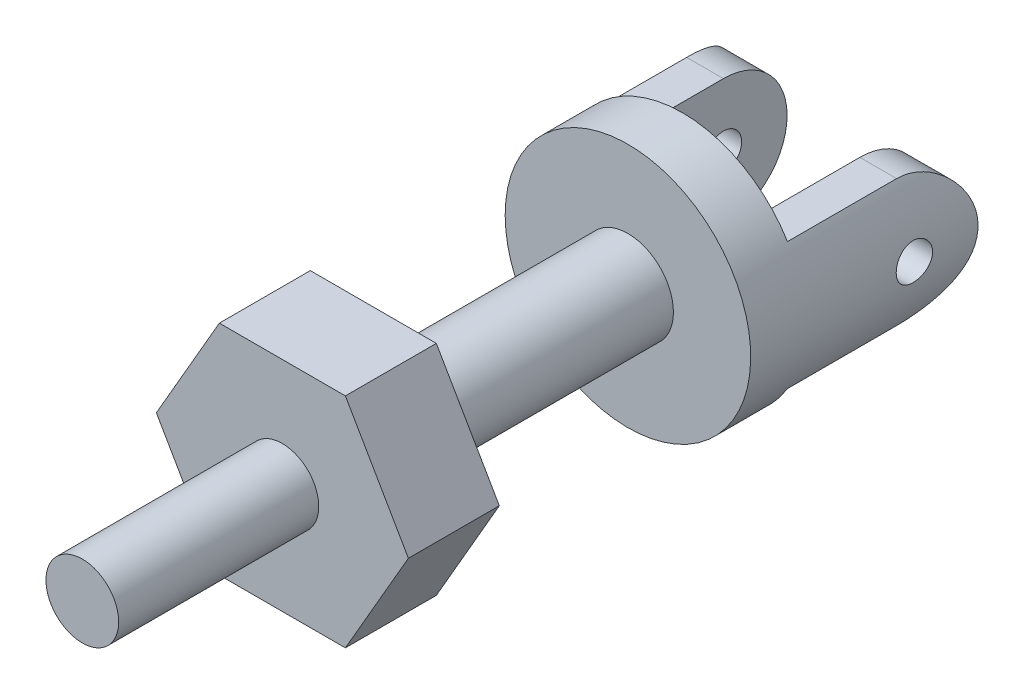
ISO-10303-21;
HEADER;
FILE_DESCRIPTION(('STEP AP214'),'2;1');
FILE_NAME('part.step','',(''),(''),'','','');
FILE_SCHEMA(('AUTOMOTIVE_DESIGN { 1 0 10303 214 1 1 1 1 }'));
ENDSEC;
DATA;
#1=APPLICATION_CONTEXT('core data for automotive mechanical design processes');
#2=APPLICATION_PROTOCOL_DEFINITION('international standard','automotive_design',2000,#1);
#3=PRODUCT_CONTEXT('',#1,'mechanical');
#4=PRODUCT('Part','Part','',(#3));
#5=PRODUCT_RELATED_PRODUCT_CATEGORY('part','',(#4));
#6=PRODUCT_DEFINITION_FORMATION('','',#4);
#7=PRODUCT_DEFINITION_CONTEXT('part definition',#1,'design');
#8=PRODUCT_DEFINITION('design','',#6,#7);
#9=PRODUCT_DEFINITION_SHAPE('','',#8);
#10=(LENGTH_UNIT() NAMED_UNIT(*) SI_UNIT(.MILLI.,.METRE.));
#11=(NAMED_UNIT(*) PLANE_ANGLE_UNIT() SI_UNIT($,.RADIAN.));
#12=(NAMED_UNIT(*) SI_UNIT($,.STERADIAN.) SOLID_ANGLE_UNIT());
#13=UNCERTAINTY_MEASURE_WITH_UNIT(LENGTH_MEASURE(1.E-05),#10,'distance_accuracy_value','');
#14=(GEOMETRIC_REPRESENTATION_CONTEXT(3) GLOBAL_UNCERTAINTY_ASSIGNED_CONTEXT((#13)) GLOBAL_UNIT_ASSIGNED_CONTEXT((#10,
#11,#12)) REPRESENTATION_CONTEXT('',''));
#15=CARTESIAN_POINT('',(0.,0.,0.));
#16=DIRECTION('',(0.,0.,1.));
#17=DIRECTION('',(1.,0.,0.));
#18=AXIS2_PLACEMENT_3D('',#15,#16,#17);
#19=CARTESIAN_POINT('',(0.,0.,-17.));
#20=DIRECTION('',(0.,0.,1.));
#21=DIRECTION('',(1.,0.,0.));
#22=AXIS2_PLACEMENT_3D('',#19,#20,#21);
#23=CYLINDRICAL_SURFACE('',#22,6.75);
#24=CARTESIAN_POINT('',(6.75,0.,-24.));
#25=CARTESIAN_POINT('',(6.74999911272059,-0.055842540910166,-23.9999976909739));
#26=CARTESIAN_POINT('',(6.74929975767196,-0.111717684844449,-23.9953066262002));
#27=CARTESIAN_POINT('',(6.74657719642042,-0.221906738606192,-23.9766707451346));
#28=CARTESIAN_POINT('',(6.74455269374564,-0.276219065053058,-23.9627168662834));
#29=CARTESIAN_POINT('',(6.73940739080019,-0.381671836837065,-23.9259809826003));
#30=CARTESIAN_POINT('',(6.73628741208205,-0.43281462544751,-23.9032055921468));
#31=CARTESIAN_POINT('',(6.72929609307386,-0.530544531243024,-23.8494892287142));
#32=CARTESIAN_POINT('',(6.72542485910577,-0.577132291680522,-23.8185494109893));
#33=CARTESIAN_POINT('',(6.71732864075089,-0.664793017751611,-23.7491309350935));
#34=CARTESIAN_POINT('',(6.71310142384377,-0.705826205517572,-23.7106023010483));
#35=CARTESIAN_POINT('',(6.70478718892022,-0.780869855713781,-23.6272074094649));
#36=CARTESIAN_POINT('',(6.70070017890102,-0.81487991810721,-23.5823407911604));
#37=CARTESIAN_POINT('',(6.69310742202681,-0.875066235908765,-23.4872769283577));
#38=CARTESIAN_POINT('',(6.6896045599627,-0.901204098047282,-23.4370551261348));
#39=CARTESIAN_POINT('',(6.68360711396162,-0.944658716040232,-23.3328737482525));
#40=CARTESIAN_POINT('',(6.68111247643255,-0.961975940767681,-23.2789143714423));
#41=CARTESIAN_POINT('',(6.67743583632494,-0.987174376659307,-23.1692074990302));
#42=CARTESIAN_POINT('',(6.67624437438597,-0.995123620308465,-23.1134759525087));
#43=CARTESIAN_POINT('',(6.67528025275461,-1.0015711832689,-23.0014582086667));
#44=CARTESIAN_POINT('',(6.67550751356993,-1.00007003209414,-22.9451720425985));
#45=CARTESIAN_POINT('',(6.67734650914669,-0.98771503469444,-22.834122886774));
#46=CARTESIAN_POINT('',(6.67894703709383,-0.976936892914969,-22.7793512620758));
#47=CARTESIAN_POINT('',(6.68333472365175,-0.946452342629807,-22.6724025809788));
#48=CARTESIAN_POINT('',(6.68612191507621,-0.926745687231395,-22.6202255963716));
#49=CARTESIAN_POINT('',(6.69258128775432,-0.878884561850783,-22.5197165856181));
#50=CARTESIAN_POINT('',(6.69625682457254,-0.850697959155642,-22.4714000851476));
#51=CARTESIAN_POINT('',(6.70407630948204,-0.786699945498342,-22.3801539640613));
#52=CARTESIAN_POINT('',(6.70822028756469,-0.75088804620629,-22.3372246887274));
#53=CARTESIAN_POINT('',(6.71655927335414,-0.67224013372588,-22.2575328147743));
#54=CARTESIAN_POINT('',(6.7207543845646,-0.629339018930791,-22.2208344453194));
#55=CARTESIAN_POINT('',(6.72868539581363,-0.537952544972292,-22.155148804508));
#56=CARTESIAN_POINT('',(6.73242129392949,-0.48946716242943,-22.126161565437));
#57=CARTESIAN_POINT('',(6.73901671048289,-0.388233293631783,-22.0767179850269));
#58=CARTESIAN_POINT('',(6.74187572726903,-0.335482388854874,-22.0562665244811));
#59=CARTESIAN_POINT('',(6.74639102909035,-0.227243041616983,-22.0245304925167));
#60=CARTESIAN_POINT('',(6.74804739342113,-0.171754779898364,-22.0132453167232));
#61=CARTESIAN_POINT('',(6.74996027662796,-0.0601702510974144,-22.000247433234));
#62=CARTESIAN_POINT('',(6.75022971002842,-0.00408448467763438,-21.9984464094182));
#63=CARTESIAN_POINT('',(6.74937350522533,0.107588256207566,-22.0042336439311));
#64=CARTESIAN_POINT('',(6.74824790911938,0.163175245673515,-22.0118216189294));
#65=CARTESIAN_POINT('',(6.74473610882736,0.272005564748214,-22.0360980220436));
#66=CARTESIAN_POINT('',(6.74235585630278,0.325258684419559,-22.0527434964207));
#67=CARTESIAN_POINT('',(6.736600801366,0.428218204093145,-22.0946171488986));
#68=CARTESIAN_POINT('',(6.73322595324427,0.477924440957679,-22.1198457214687));
#69=CARTESIAN_POINT('',(6.72582473545489,0.572768052310922,-22.1783771366065));
#70=CARTESIAN_POINT('',(6.72179390576589,0.617870444216264,-22.2117360902563));
#71=CARTESIAN_POINT('',(6.71354345616816,0.701868155947209,-22.2855031079937));
#72=CARTESIAN_POINT('',(6.70932382558081,0.740763124109861,-22.3259115711788));
#73=CARTESIAN_POINT('',(6.70113048938946,0.811562616638169,-22.4130234049341));
#74=CARTESIAN_POINT('',(6.69715905164284,0.843407990393645,-22.4597750953769));
#75=CARTESIAN_POINT('',(6.68995170503097,0.898793373321402,-22.5580159613304));
#76=CARTESIAN_POINT('',(6.68671577667948,0.922333602535498,-22.6095050112808));
#77=CARTESIAN_POINT('',(6.68136217784517,0.960348470530135,-22.7155814744695));
#78=CARTESIAN_POINT('',(6.67924064990097,0.974854414016818,-22.7701574657212));
#79=CARTESIAN_POINT('',(6.67634573947977,0.994488675177337,-22.8810047537763));
#80=CARTESIAN_POINT('',(6.67557226638415,0.999617623190394,-22.9372759363674));
#81=CARTESIAN_POINT('',(6.67546436730878,1.00033757943703,-23.0493267995347));
#82=CARTESIAN_POINT('',(6.67611591022978,0.996021584936614,-23.1051058913773));
#83=CARTESIAN_POINT('',(6.67875416313144,0.978173271070795,-23.2151356901121));
#84=CARTESIAN_POINT('',(6.68074087117957,0.964640965045214,-23.2693863992164));
#85=CARTESIAN_POINT('',(6.6858207421393,0.928776749344403,-23.3747947554377));
#86=CARTESIAN_POINT('',(6.68891310765919,0.906451180127707,-23.4259546006592));
#87=CARTESIAN_POINT('',(6.69585685750153,0.853643415012498,-23.5238174857813));
#88=CARTESIAN_POINT('',(6.69970826624953,0.823160956618996,-23.5705203821881));
#89=CARTESIAN_POINT('',(6.70778131838235,0.75456623134579,-23.658616385123));
#90=CARTESIAN_POINT('',(6.7120060970762,0.716385046344522,-23.6999555482106));
#91=CARTESIAN_POINT('',(6.72032356595988,0.633622295064077,-23.7756731917375));
#92=CARTESIAN_POINT('',(6.72441622518943,0.589039241744767,-23.810050050473));
#93=CARTESIAN_POINT('',(6.73203333976492,0.494457481821442,-23.8710314318147));
#94=CARTESIAN_POINT('',(6.73555463068598,0.444431017911157,-23.897593290153));
#95=CARTESIAN_POINT('',(6.74160116950649,0.340598638239511,-23.9418980659904));
#96=CARTESIAN_POINT('',(6.74412745252672,0.28679671917619,-23.9596501534456));
#97=CARTESIAN_POINT('',(6.7473200627825,0.193958660761501,-23.9817862974269));
#98=CARTESIAN_POINT('',(6.74831989929762,0.155496645397279,-23.9886060480909));
#99=CARTESIAN_POINT('',(6.74966017396957,0.0780283890929518,-23.9977136790094));
#100=CARTESIAN_POINT('',(6.75000062002111,0.03902215467426,-24.0000016135221));
#101=CARTESIAN_POINT('',(6.75,0.,-24.));
#102=B_SPLINE_CURVE_WITH_KNOTS('',3,(#24,#25,#26,#27,#28,#29,#30,#31,#32,#33,#34,#35,#36,#37,
#38,#39,#40,#41,#42,#43,#44,#45,#46,#47,#48,#49,#50,#51,#52,#53,#54,#55,#56,#57,#58,#59,#60,#61,
#62,#63,#64,#65,#66,#67,#68,#69,#70,#71,#72,#73,#74,#75,#76,#77,#78,#79,#80,#81,#82,#83,#84,#85,
#86,#87,#88,#89,#90,#91,#92,#93,#94,#95,#96,#97,#98,#99,#100,#101),.UNSPECIFIED.,.T.,.F.,(4,2,2,
2,2,2,2,2,2,2,2,2,2,2,2,2,2,2,2,2,2,2,2,2,2,2,2,2,2,2,2,2,2,2,2,2,2,2,4),(0.,0.167385036095001,
0.334934080339171,0.502357738579202,0.669757719315227,0.838299369512643,1.00685061718639,
1.17621106378315,1.34556250685453,1.51367634882374,1.68178077130974,1.84852625275946,
2.01527634536397,2.18266643054019,2.35006723873285,2.51910075696945,2.68813498291829,
2.85726573135218,3.02638532731912,3.19392726588316,3.36146414868354,3.52821335257178,
3.69497022109769,3.86291226368386,4.03086381714738,4.20017525181088,4.36948220029192,
4.53819917064465,4.70690479910917,4.87395678992066,5.04100853893916,5.20794005372038,
5.37487694113277,5.54338046523498,5.71192319321397,5.88136966036332,6.05063938138702,
6.16760760787006,6.28457443391695),.UNSPECIFIED.);
#103=CARTESIAN_POINT('',(6.75,0.,-24.));
#104=VERTEX_POINT('',#103);
#105=EDGE_CURVE('E367',#104,#104,#102,.T.);
#106=ORIENTED_EDGE('',*,*,#105,.T.);
#107=EDGE_LOOP('',(#106));
#108=FACE_BOUND('',#107,.T.);
#109=CARTESIAN_POINT('',(-6.75,0.,-24.));
#110=CARTESIAN_POINT('',(-6.74999911272059,0.0558425409101661,-23.9999976909739));
#111=CARTESIAN_POINT('',(-6.74929975767196,0.111717684844449,-23.9953066262002));
#112=CARTESIAN_POINT('',(-6.74657719642042,0.221906738606192,-23.9766707451346));
#113=CARTESIAN_POINT('',(-6.74455269374564,0.276219065053058,-23.9627168662834));
#114=CARTESIAN_POINT('',(-6.73940739080019,0.381671836837065,-23.9259809826003));
#115=CARTESIAN_POINT('',(-6.73628741208205,0.43281462544751,-23.9032055921468));
#116=CARTESIAN_POINT('',(-6.72929609307386,0.530544531243024,-23.8494892287142));
#117=CARTESIAN_POINT('',(-6.72542485910577,0.577132291680522,-23.8185494109893));
#118=CARTESIAN_POINT('',(-6.71732864075089,0.664793017751611,-23.7491309350935));
#119=CARTESIAN_POINT('',(-6.71310142384377,0.705826205517572,-23.7106023010483));
#120=CARTESIAN_POINT('',(-6.70478718892022,0.780869855713782,-23.6272074094649));
#121=CARTESIAN_POINT('',(-6.70070017890102,0.81487991810721,-23.5823407911604));
#122=CARTESIAN_POINT('',(-6.69310742202681,0.875066235908764,-23.4872769283577));
#123=CARTESIAN_POINT('',(-6.6896045599627,0.901204098047281,-23.4370551261348));
#124=CARTESIAN_POINT('',(-6.68360711396161,0.944658716040232,-23.3328737482525));
#125=CARTESIAN_POINT('',(-6.68111247643255,0.961975940767681,-23.2789143714423));
#126=CARTESIAN_POINT('',(-6.67743583632494,0.987174376659307,-23.1692074990302));
#127=CARTESIAN_POINT('',(-6.67624437438597,0.995123620308465,-23.1134759525087));
#128=CARTESIAN_POINT('',(-6.67528025275461,1.0015711832689,-23.0014582086667));
#129=CARTESIAN_POINT('',(-6.67550751356993,1.00007003209414,-22.9451720425985));
#130=CARTESIAN_POINT('',(-6.67734650914669,0.98771503469444,-22.834122886774));
#131=CARTESIAN_POINT('',(-6.67894703709383,0.976936892914968,-22.7793512620758));
#132=CARTESIAN_POINT('',(-6.68333472365175,0.946452342629807,-22.6724025809788));
#133=CARTESIAN_POINT('',(-6.68612191507621,0.926745687231396,-22.6202255963716));
#134=CARTESIAN_POINT('',(-6.69258128775432,0.878884561850783,-22.5197165856181));
#135=CARTESIAN_POINT('',(-6.69625682457254,0.850697959155642,-22.4714000851476));
#136=CARTESIAN_POINT('',(-6.70407630948204,0.786699945498342,-22.3801539640613));
#137=CARTESIAN_POINT('',(-6.70822028756469,0.750888046206289,-22.3372246887274));
#138=CARTESIAN_POINT('',(-6.71655927335414,0.672240133725879,-22.2575328147743));
#139=CARTESIAN_POINT('',(-6.7207543845646,0.629339018930791,-22.2208344453194));
#140=CARTESIAN_POINT('',(-6.72868539581363,0.537952544972292,-22.155148804508));
#141=CARTESIAN_POINT('',(-6.73242129392949,0.489467162429429,-22.126161565437));
#142=CARTESIAN_POINT('',(-6.73901671048289,0.388233293631783,-22.0767179850269));
#143=CARTESIAN_POINT('',(-6.74187572726903,0.335482388854874,-22.0562665244811));
#144=CARTESIAN_POINT('',(-6.74639102909035,0.227243041616983,-22.0245304925167));
#145=CARTESIAN_POINT('',(-6.74804739342113,0.171754779898364,-22.0132453167232));
#146=CARTESIAN_POINT('',(-6.74996027662796,0.060170251097414,-22.000247433234));
#147=CARTESIAN_POINT('',(-6.75022971002842,0.00408448467763391,-21.9984464094182));
#148=CARTESIAN_POINT('',(-6.74937350522533,-0.107588256207567,-22.0042336439311));
#149=CARTESIAN_POINT('',(-6.74824790911938,-0.163175245673516,-22.0118216189294));
#150=CARTESIAN_POINT('',(-6.74473610882736,-0.272005564748214,-22.0360980220436));
#151=CARTESIAN_POINT('',(-6.74235585630278,-0.325258684419559,-22.0527434964207));
#152=CARTESIAN_POINT('',(-6.736600801366,-0.428218204093145,-22.0946171488986));
#153=CARTESIAN_POINT('',(-6.73322595324427,-0.47792444095768,-22.1198457214687));
#154=CARTESIAN_POINT('',(-6.72582473545489,-0.572768052310923,-22.1783771366065));
#155=CARTESIAN_POINT('',(-6.72179390576589,-0.617870444216265,-22.2117360902563));
#156=CARTESIAN_POINT('',(-6.71354345616816,-0.70186815594721,-22.2855031079937));
#157=CARTESIAN_POINT('',(-6.70932382558081,-0.740763124109862,-22.3259115711788));
#158=CARTESIAN_POINT('',(-6.70113048938946,-0.81156261663817,-22.4130234049341));
#159=CARTESIAN_POINT('',(-6.69715905164284,-0.843407990393645,-22.4597750953769));
#160=CARTESIAN_POINT('',(-6.68995170503097,-0.898793373321402,-22.5580159613304));
#161=CARTESIAN_POINT('',(-6.68671577667948,-0.922333602535497,-22.6095050112808));
#162=CARTESIAN_POINT('',(-6.68136217784517,-0.960348470530135,-22.7155814744695));
#163=CARTESIAN_POINT('',(-6.67924064990097,-0.974854414016818,-22.7701574657212));
#164=CARTESIAN_POINT('',(-6.67634573947977,-0.994488675177337,-22.8810047537763));
#165=CARTESIAN_POINT('',(-6.67557226638415,-0.999617623190394,-22.9372759363674));
#166=CARTESIAN_POINT('',(-6.67546436730878,-1.00033757943703,-23.0493267995347));
#167=CARTESIAN_POINT('',(-6.67611591022978,-0.996021584936614,-23.1051058913773));
#168=CARTESIAN_POINT('',(-6.67875416313144,-0.978173271070795,-23.2151356901121));
#169=CARTESIAN_POINT('',(-6.68074087117957,-0.964640965045214,-23.2693863992164));
#170=CARTESIAN_POINT('',(-6.6858207421393,-0.928776749344403,-23.3747947554377));
#171=CARTESIAN_POINT('',(-6.68891310765919,-0.906451180127707,-23.4259546006592));
#172=CARTESIAN_POINT('',(-6.69585685750153,-0.853643415012498,-23.5238174857813));
#173=CARTESIAN_POINT('',(-6.69970826624953,-0.823160956618996,-23.5705203821881));
#174=CARTESIAN_POINT('',(-6.70778131838235,-0.75456623134579,-23.658616385123));
#175=CARTESIAN_POINT('',(-6.7120060970762,-0.716385046344522,-23.6999555482106));
#176=CARTESIAN_POINT('',(-6.72032356595988,-0.633622295064077,-23.7756731917375));
#177=CARTESIAN_POINT('',(-6.72441622518943,-0.589039241744767,-23.810050050473));
#178=CARTESIAN_POINT('',(-6.73203333976492,-0.494457481821442,-23.8710314318147));
#179=CARTESIAN_POINT('',(-6.73555463068598,-0.444431017911157,-23.897593290153));
#180=CARTESIAN_POINT('',(-6.74160116950649,-0.340598638239511,-23.9418980659904));
#181=CARTESIAN_POINT('',(-6.74412745252672,-0.28679671917619,-23.9596501534456));
#182=CARTESIAN_POINT('',(-6.7473200627825,-0.193958660761501,-23.9817862974269));
#183=CARTESIAN_POINT('',(-6.74831989929762,-0.155496645397279,-23.9886060480909));
#184=CARTESIAN_POINT('',(-6.74966017396957,-0.0780283890929521,-23.9977136790094));
#185=CARTESIAN_POINT('',(-6.75000062002111,-0.0390221546742602,-24.0000016135221));
#186=CARTESIAN_POINT('',(-6.75,0.,-24.));
#187=B_SPLINE_CURVE_WITH_KNOTS('',3,(#109,#110,#111,#112,#113,#114,#115,#116,#117,#118,#119,
#120,#121,#122,#123,#124,#125,#126,#127,#128,#129,#130,#131,#132,#133,#134,#135,#136,#137,#138,
#139,#140,#141,#142,#143,#144,#145,#146,#147,#148,#149,#150,#151,#152,#153,#154,#155,#156,#157,
#158,#159,#160,#161,#162,#163,#164,#165,#166,#167,#168,#169,#170,#171,#172,#173,#174,#175,#176,
#177,#178,#179,#180,#181,#182,#183,#184,#185,#186),.UNSPECIFIED.,.T.,.F.,(4,2,2,2,2,2,2,2,2,2,2,
2,2,2,2,2,2,2,2,2,2,2,2,2,2,2,2,2,2,2,2,2,2,2,2,2,2,2,4),(0.,0.167385036095001,0.33493408033917,
0.502357738579202,0.669757719315227,0.838299369512641,1.00685061718639,1.17621106378314,
1.34556250685453,1.51367634882374,1.68178077130974,1.84852625275946,2.01527634536397,
2.18266643054019,2.35006723873285,2.51910075696945,2.6881349829183,2.85726573135218,
3.02638532731912,3.19392726588316,3.36146414868354,3.52821335257178,3.69497022109769,
3.86291226368386,4.03086381714738,4.20017525181088,4.36948220029192,4.53819917064465,
4.70690479910917,4.87395678992066,5.04100853893916,5.20794005372038,5.37487694113277,
5.54338046523498,5.71192319321397,5.88136966036332,6.05063938138702,6.16760760787006,
6.28457443391695),.UNSPECIFIED.);
#188=CARTESIAN_POINT('',(-6.75,0.,-24.));
#189=VERTEX_POINT('',#188);
#190=EDGE_CURVE('E360',#189,#189,#187,.T.);
#191=ORIENTED_EDGE('',*,*,#190,.T.);
#192=EDGE_LOOP('',(#191));
#193=FACE_BOUND('',#192,.T.);
#194=CARTESIAN_POINT('',(0.,0.,-14.));
#195=DIRECTION('',(0.,0.,-1.));
#196=DIRECTION('',(-1.,0.,0.));
#197=AXIS2_PLACEMENT_3D('',#194,#195,#196);
#198=CIRCLE('',#197,6.75);
#199=CARTESIAN_POINT('',(-6.75,0.,-14.));
#200=VERTEX_POINT('',#199);
#201=EDGE_CURVE('E218',#200,#200,#198,.T.);
#202=ORIENTED_EDGE('',*,*,#201,.T.);
#203=EDGE_LOOP('',(#202));
#204=FACE_BOUND('',#203,.T.);
#205=DIRECTION('',(0.,0.,1.));
#206=VECTOR('',#205,1.);
#207=CARTESIAN_POINT('',(5.7716981903076,-3.5,-26.5));
#208=LINE('',#207,#206);
#209=CARTESIAN_POINT('',(5.77169819030759,-3.49999999999999,-23.));
#210=VERTEX_POINT('',#209);
#211=CARTESIAN_POINT('',(5.7716981903076,-3.5,-17.));
#212=VERTEX_POINT('',#211);
#213=EDGE_CURVE('E216',#210,#212,#208,.T.);
#214=ORIENTED_EDGE('',*,*,#213,.F.);
#215=CARTESIAN_POINT('',(5.7716981903076,3.5,-23.));
#216=CARTESIAN_POINT('',(5.77166955421002,3.50001705554504,-23.0911296720306));
#217=CARTESIAN_POINT('',(5.77385573039003,3.49644148706506,-23.1822433063665));
#218=CARTESIAN_POINT('',(5.78244171296421,3.48223957213489,-23.3636602749527));
#219=CARTESIAN_POINT('',(5.78883869884604,3.47161794528503,-23.4539641106151));
#220=CARTESIAN_POINT('',(5.8055794457996,3.44354424311247,-23.6325588453453));
#221=CARTESIAN_POINT('',(5.81589880800477,3.42613437661979,-23.7208586824379));
#222=CARTESIAN_POINT('',(5.8400971794397,3.3847214842465,-23.8953846300326));
#223=CARTESIAN_POINT('',(5.85397664340042,3.36071761608778,-23.981610474084));
#224=CARTESIAN_POINT('',(5.90020187745128,3.27933331417957,-24.235939769041));
#225=CARTESIAN_POINT('',(5.93719387256824,3.21248677463198,-24.4002758228421));
#226=CARTESIAN_POINT('',(6.01931780913164,3.05583264232749,-24.7155181456973));
#227=CARTESIAN_POINT('',(6.06446323301233,2.96598691404088,-24.8664015428341));
#228=CARTESIAN_POINT('',(6.16264056776469,2.75660193180785,-25.1650012631881));
#229=CARTESIAN_POINT('',(6.21601685999562,2.63514101237681,-25.3112609853852));
#230=CARTESIAN_POINT('',(6.32186227552666,2.37001501026078,-25.5824506155107));
#231=CARTESIAN_POINT('',(6.37433103978394,2.22634135335382,-25.7073722474757));
#232=CARTESIAN_POINT('',(6.47713032509301,1.90767178791381,-25.9415319664244));
#233=CARTESIAN_POINT('',(6.52701273178548,1.73114219734409,-26.0489165521625));
#234=CARTESIAN_POINT('',(6.59252243494399,1.45268714248443,-26.1859746896809));
#235=CARTESIAN_POINT('',(6.61280630524951,1.35759448846738,-26.2276568912017));
#236=CARTESIAN_POINT('',(6.64970570263882,1.16347180275601,-26.3025976795009));
#237=CARTESIAN_POINT('',(6.66632220054168,1.06444282128917,-26.3358584959144));
#238=CARTESIAN_POINT('',(6.70325793796902,0.808346178347381,-26.4092047876708));
#239=CARTESIAN_POINT('',(6.72066792574392,0.649032894259845,-26.4431472978045));
#240=CARTESIAN_POINT('',(6.74403968155987,0.326492109055726,-26.4885444837744));
#241=CARTESIAN_POINT('',(6.75000510269833,0.163265873799953,-26.5000063354468));
#242=CARTESIAN_POINT('',(6.74999426917082,-0.183363540953695,-26.4999928846737));
#243=CARTESIAN_POINT('',(6.74245762627459,-0.366777079930822,-26.4855203872262));
#244=CARTESIAN_POINT('',(6.71307969249925,-0.727990267216296,-26.4283413782658));
#245=CARTESIAN_POINT('',(6.6912304660912,-0.905786743819561,-26.3856192037591));
#246=CARTESIAN_POINT('',(6.63549697804145,-1.2502132149756,-26.2740853297312));
#247=CARTESIAN_POINT('',(6.60165505000524,-1.41688006807026,-26.2053653441941));
#248=CARTESIAN_POINT('',(6.52498977679903,-1.73608609268259,-26.0443390011145));
#249=CARTESIAN_POINT('',(6.482164616279,-1.88862239967496,-25.9520278754017));
#250=CARTESIAN_POINT('',(6.38822453662088,-2.18607698720936,-25.739804038613));
#251=CARTESIAN_POINT('',(6.33675608268062,-2.32989818981952,-25.6185118676454));
#252=CARTESIAN_POINT('',(6.23239813645147,-2.59619176957678,-25.3547805876641));
#253=CARTESIAN_POINT('',(6.17950732609221,-2.7186434979309,-25.2123212687008));
#254=CARTESIAN_POINT('',(6.07301991608375,-2.94930903512128,-24.8955441184375));
#255=CARTESIAN_POINT('',(6.01975168260832,-3.05540163910414,-24.7195419513625));
#256=CARTESIAN_POINT('',(5.94847215092402,-3.19073390424003,-24.4421572873763));
#257=CARTESIAN_POINT('',(5.92615721445445,-3.23186426667083,-24.3475092158008));
#258=CARTESIAN_POINT('',(5.88523085987807,-3.305804412711,-24.1542678064187));
#259=CARTESIAN_POINT('',(5.86661687095029,-3.33861997647863,-24.0556772647871));
#260=CARTESIAN_POINT('',(5.83770575121213,-3.38885286422883,-23.8786689773139));
#261=CARTESIAN_POINT('',(5.82648140039545,-3.40807647409248,-23.8009085732122));
#262=CARTESIAN_POINT('',(5.80698300904305,-3.44119398640323,-23.643907733566));
#263=CARTESIAN_POINT('',(5.7987082133648,-3.45508925307723,-23.5646676823145));
#264=CARTESIAN_POINT('',(5.7853283424933,-3.47744975957481,-23.4048182151242));
#265=CARTESIAN_POINT('',(5.78023664157442,-3.48589209290092,-23.3242044640658));
#266=CARTESIAN_POINT('',(5.77341130360068,-3.49717450838588,-23.1623968818766));
#267=CARTESIAN_POINT('',(5.77167969418554,-3.50001120785646,-23.0812027301436));
#268=CARTESIAN_POINT('',(5.7716981903076,-3.5,-23.));
#269=B_SPLINE_CURVE_WITH_KNOTS('',3,(#215,#216,#217,#218,#219,#220,#221,#222,#223,#224,#225,
#226,#227,#228,#229,#230,#231,#232,#233,#234,#235,#236,#237,#238,#239,#240,#241,#242,#243,#244,
#245,#246,#247,#248,#249,#250,#251,#252,#253,#254,#255,#256,#257,#258,#259,#260,#261,#262,#263,
#264,#265,#266,#267,#268),.UNSPECIFIED.,.F.,.F.,(4,2,2,2,2,2,2,2,2,2,2,2,2,2,2,2,2,2,2,2,2,2,2,
2,2,2,4),(0.,0.273266457469634,0.546350059803081,0.817762050779359,1.08920872642422,
1.63035056553494,2.17239556411608,2.76231271942996,3.35245815672481,3.9864270169589,
4.30339604861505,4.62028107199126,5.10968645463684,5.59893559342907,6.14841021668935,
6.69818975112102,7.2460476135316,7.7940162950224,8.37674582580402,8.9600353529228,
9.59334043484272,9.90972008307292,10.2258791880275,10.4683092152784,10.7106771311512,
10.9540566679023,11.1975830258738),.UNSPECIFIED.);
#270=CARTESIAN_POINT('',(5.77169819030759,3.5,-23.));
#271=VERTEX_POINT('',#270);
#272=EDGE_CURVE('E184',#271,#210,#269,.T.);
#273=ORIENTED_EDGE('',*,*,#272,.F.);
#274=DIRECTION('',(0.,0.,1.));
#275=VECTOR('',#274,1.);
#276=CARTESIAN_POINT('',(5.7716981903076,3.5,-26.5));
#277=LINE('',#276,#275);
#278=CARTESIAN_POINT('',(5.7716981903076,3.5,-17.));
#279=VERTEX_POINT('',#278);
#280=EDGE_CURVE('E211',#271,#279,#277,.T.);
#281=ORIENTED_EDGE('',*,*,#280,.T.);
#282=CARTESIAN_POINT('',(0.,0.,-17.));
#283=DIRECTION('',(0.,0.,-1.));
#284=DIRECTION('',(-1.,0.,0.));
#285=AXIS2_PLACEMENT_3D('',#282,#283,#284);
#286=CIRCLE('',#285,6.75);
#287=CARTESIAN_POINT('',(-5.7716981903076,3.5,-17.));
#288=VERTEX_POINT('',#287);
#289=EDGE_CURVE('E222',#288,#279,#286,.T.);
#290=ORIENTED_EDGE('',*,*,#289,.F.);
#291=DIRECTION('',(0.,0.,1.));
#292=VECTOR('',#291,1.);
#293=CARTESIAN_POINT('',(-5.7716981903076,3.5,-26.5));
#294=LINE('',#293,#292);
#295=CARTESIAN_POINT('',(-5.7716981903076,3.5,-23.));
#296=VERTEX_POINT('',#295);
#297=EDGE_CURVE('E181',#296,#288,#294,.T.);
#298=ORIENTED_EDGE('',*,*,#297,.F.);
#299=CARTESIAN_POINT('',(-5.7716981903076,-3.5,-23.));
#300=CARTESIAN_POINT('',(-5.77166955421002,-3.50001705554504,-23.0911296720306));
#301=CARTESIAN_POINT('',(-5.77385573039003,-3.49644148706506,-23.1822433063665));
#302=CARTESIAN_POINT('',(-5.78244171296421,-3.48223957213489,-23.3636602749527));
#303=CARTESIAN_POINT('',(-5.78883869884604,-3.47161794528503,-23.4539641106151));
#304=CARTESIAN_POINT('',(-5.8055794457996,-3.44354424311247,-23.6325588453453));
#305=CARTESIAN_POINT('',(-5.81589880800477,-3.42613437661979,-23.7208586824379));
#306=CARTESIAN_POINT('',(-5.8400971794397,-3.3847214842465,-23.8953846300326));
#307=CARTESIAN_POINT('',(-5.85397664340042,-3.36071761608778,-23.981610474084));
#308=CARTESIAN_POINT('',(-5.90020187745128,-3.27933331417957,-24.235939769041));
#309=CARTESIAN_POINT('',(-5.93719387256824,-3.21248677463198,-24.4002758228421));
#310=CARTESIAN_POINT('',(-6.01931780913164,-3.05583264232749,-24.7155181456973));
#311=CARTESIAN_POINT('',(-6.06446323301233,-2.96598691404088,-24.8664015428341));
#312=CARTESIAN_POINT('',(-6.16264056776469,-2.75660193180785,-25.1650012631881));
#313=CARTESIAN_POINT('',(-6.21601685999562,-2.63514101237681,-25.3112609853852));
#314=CARTESIAN_POINT('',(-6.32186227552666,-2.37001501026078,-25.5824506155107));
#315=CARTESIAN_POINT('',(-6.37433103978394,-2.22634135335382,-25.7073722474757));
#316=CARTESIAN_POINT('',(-6.47713032509301,-1.90767178791381,-25.9415319664244));
#317=CARTESIAN_POINT('',(-6.52701273178548,-1.73114219734409,-26.0489165521625));
#318=CARTESIAN_POINT('',(-6.59252243494399,-1.45268714248443,-26.1859746896809));
#319=CARTESIAN_POINT('',(-6.61280630524951,-1.35759448846738,-26.2276568912017));
#320=CARTESIAN_POINT('',(-6.64970570263882,-1.16347180275601,-26.3025976795009));
#321=CARTESIAN_POINT('',(-6.66632220054168,-1.06444282128917,-26.3358584959144));
#322=CARTESIAN_POINT('',(-6.70325793796902,-0.808346178347382,-26.4092047876708));
#323=CARTESIAN_POINT('',(-6.72066792574392,-0.649032894259845,-26.4431472978045));
#324=CARTESIAN_POINT('',(-6.74403968155987,-0.326492109055726,-26.4885444837744));
#325=CARTESIAN_POINT('',(-6.75000510269833,-0.163265873799953,-26.5000063354468));
#326=CARTESIAN_POINT('',(-6.74999426917082,0.183363540953696,-26.4999928846737));
#327=CARTESIAN_POINT('',(-6.74245762627459,0.366777079930822,-26.4855203872262));
#328=CARTESIAN_POINT('',(-6.71307969249925,0.727990267216296,-26.4283413782658));
#329=CARTESIAN_POINT('',(-6.6912304660912,0.905786743819561,-26.3856192037591));
#330=CARTESIAN_POINT('',(-6.63549697804145,1.2502132149756,-26.2740853297312));
#331=CARTESIAN_POINT('',(-6.60165505000524,1.41688006807026,-26.2053653441941));
#332=CARTESIAN_POINT('',(-6.52498977679903,1.73608609268259,-26.0443390011145));
#333=CARTESIAN_POINT('',(-6.482164616279,1.88862239967496,-25.9520278754017));
#334=CARTESIAN_POINT('',(-6.38822453662088,2.18607698720936,-25.739804038613));
#335=CARTESIAN_POINT('',(-6.33675608268062,2.32989818981951,-25.6185118676454));
#336=CARTESIAN_POINT('',(-6.23239813645147,2.59619176957678,-25.3547805876641));
#337=CARTESIAN_POINT('',(-6.17950732609221,2.7186434979309,-25.2123212687008));
#338=CARTESIAN_POINT('',(-6.07301991608375,2.94930903512128,-24.8955441184375));
#339=CARTESIAN_POINT('',(-6.01975168260832,3.05540163910414,-24.7195419513625));
#340=CARTESIAN_POINT('',(-5.94847215092402,3.19073390424003,-24.4421572873763));
#341=CARTESIAN_POINT('',(-5.92615721445445,3.23186426667083,-24.3475092158008));
#342=CARTESIAN_POINT('',(-5.88523085987807,3.305804412711,-24.1542678064187));
#343=CARTESIAN_POINT('',(-5.86661687095029,3.33861997647863,-24.0556772647871));
#344=CARTESIAN_POINT('',(-5.83770575121213,3.38885286422883,-23.8786689773139));
#345=CARTESIAN_POINT('',(-5.82648140039545,3.40807647409248,-23.8009085732122));
#346=CARTESIAN_POINT('',(-5.80698300904305,3.44119398640323,-23.643907733566));
#347=CARTESIAN_POINT('',(-5.7987082133648,3.45508925307723,-23.5646676823145));
#348=CARTESIAN_POINT('',(-5.7853283424933,3.47744975957481,-23.4048182151242));
#349=CARTESIAN_POINT('',(-5.78023664157442,3.48589209290092,-23.3242044640658));
#350=CARTESIAN_POINT('',(-5.77341130360068,3.49717450838588,-23.1623968818766));
#351=CARTESIAN_POINT('',(-5.77167969418554,3.50001120785646,-23.0812027301436));
#352=CARTESIAN_POINT('',(-5.7716981903076,3.5,-23.));
#353=B_SPLINE_CURVE_WITH_KNOTS('',3,(#299,#300,#301,#302,#303,#304,#305,#306,#307,#308,#309,
#310,#311,#312,#313,#314,#315,#316,#317,#318,#319,#320,#321,#322,#323,#324,#325,#326,#327,#328,
#329,#330,#331,#332,#333,#334,#335,#336,#337,#338,#339,#340,#341,#342,#343,#344,#345,#346,#347,
#348,#349,#350,#351,#352),.UNSPECIFIED.,.F.,.F.,(4,2,2,2,2,2,2,2,2,2,2,2,2,2,2,2,2,2,2,2,2,2,2,
2,2,2,4),(0.,0.273266457469634,0.546350059803081,0.817762050779359,1.08920872642422,
1.63035056553494,2.17239556411608,2.76231271942996,3.35245815672481,3.9864270169589,
4.30339604861505,4.62028107199126,5.10968645463684,5.59893559342907,6.14841021668935,
6.69818975112102,7.2460476135316,7.7940162950224,8.37674582580402,8.9600353529228,
9.59334043484272,9.90972008307292,10.2258791880275,10.4683092152784,10.7106771311512,
10.9540566679023,11.1975830258738),.UNSPECIFIED.);
#354=CARTESIAN_POINT('',(-5.7716981903076,-3.49999999999999,-23.));
#355=VERTEX_POINT('',#354);
#356=EDGE_CURVE('E174',#355,#296,#353,.T.);
#357=ORIENTED_EDGE('',*,*,#356,.F.);
#358=DIRECTION('',(0.,0.,1.));
#359=VECTOR('',#358,1.);
#360=CARTESIAN_POINT('',(-5.7716981903076,-3.5,-26.5));
#361=LINE('',#360,#359);
#362=CARTESIAN_POINT('',(-5.7716981903076,-3.5,-17.));
#363=VERTEX_POINT('',#362);
#364=EDGE_CURVE('E179',#355,#363,#361,.T.);
#365=ORIENTED_EDGE('',*,*,#364,.T.);
#366=EDGE_CURVE('E219',#212,#363,#286,.T.);
#367=ORIENTED_EDGE('',*,*,#366,.F.);
#368=EDGE_LOOP('',(#214,#273,#281,#290,#298,#357,#365,#367));
#369=FACE_BOUND('',#368,.T.);
#370=ADVANCED_FACE('F70',(#108,#193,#204,#369),#23,.T.);
#371=CARTESIAN_POINT('',(3.75,3.5,-26.5));
#372=DIRECTION('',(1.,0.,0.));
#373=DIRECTION('',(0.,0.,-1.));
#374=AXIS2_PLACEMENT_3D('',#371,#372,#373);
#375=PLANE('',#374);
#376=CARTESIAN_POINT('',(3.75,0.,-23.));
#377=DIRECTION('',(1.,0.,0.));
#378=DIRECTION('',(0.,0.,-1.));
#379=AXIS2_PLACEMENT_3D('',#376,#377,#378);
#380=CIRCLE('',#379,1.);
#381=CARTESIAN_POINT('',(3.75,0.,-24.));
#382=VERTEX_POINT('',#381);
#383=EDGE_CURVE('E368',#382,#382,#380,.T.);
#384=ORIENTED_EDGE('',*,*,#383,.T.);
#385=EDGE_LOOP('',(#384));
#386=FACE_BOUND('',#385,.T.);
#387=CARTESIAN_POINT('',(3.75,0.,-23.));
#388=DIRECTION('',(1.,0.,0.));
#389=DIRECTION('',(0.,0.,-1.));
#390=AXIS2_PLACEMENT_3D('',#387,#388,#389);
#391=CIRCLE('',#390,3.5);
#392=CARTESIAN_POINT('',(3.74999999999999,-3.49999999999999,-23.));
#393=VERTEX_POINT('',#392);
#394=CARTESIAN_POINT('',(3.74999999999999,3.5,-23.));
#395=VERTEX_POINT('',#394);
#396=EDGE_CURVE('E185',#393,#395,#391,.T.);
#397=ORIENTED_EDGE('',*,*,#396,.F.);
#398=DIRECTION('',(0.,0.,1.));
#399=VECTOR('',#398,1.);
#400=CARTESIAN_POINT('',(3.75,-3.5,-26.5));
#401=LINE('',#400,#399);
#402=CARTESIAN_POINT('',(3.75,-3.5,-17.));
#403=VERTEX_POINT('',#402);
#404=EDGE_CURVE('E214',#393,#403,#401,.T.);
#405=ORIENTED_EDGE('',*,*,#404,.T.);
#406=DIRECTION('',(0.,1.,0.));
#407=VECTOR('',#406,1.);
#408=CARTESIAN_POINT('',(3.75,3.5,-17.));
#409=LINE('',#408,#407);
#410=CARTESIAN_POINT('',(3.75,3.5,-17.));
#411=VERTEX_POINT('',#410);
#412=EDGE_CURVE('E206',#403,#411,#409,.T.);
#413=ORIENTED_EDGE('',*,*,#412,.T.);
#414=DIRECTION('',(0.,0.,1.));
#415=VECTOR('',#414,1.);
#416=CARTESIAN_POINT('',(3.75,3.5,-26.5));
#417=LINE('',#416,#415);
#418=EDGE_CURVE('E93',#395,#411,#417,.T.);
#419=ORIENTED_EDGE('',*,*,#418,.F.);
#420=EDGE_LOOP('',(#397,#405,#413,#419));
#421=FACE_BOUND('',#420,.T.);
#422=ADVANCED_FACE('F326',(#386,#421),#375,.F.);
#423=CARTESIAN_POINT('',(-3.75,-3.5,-26.5));
#424=DIRECTION('',(-1.,0.,0.));
#425=DIRECTION('',(0.,-1.,0.));
#426=AXIS2_PLACEMENT_3D('',#423,#424,#425);
#427=PLANE('',#426);
#428=CARTESIAN_POINT('',(-3.75,0.,-23.));
#429=DIRECTION('',(-1.,0.,0.));
#430=DIRECTION('',(0.,-1.,0.));
#431=AXIS2_PLACEMENT_3D('',#428,#429,#430);
#432=CIRCLE('',#431,1.);
#433=CARTESIAN_POINT('',(-3.75,-1.,-23.));
#434=VERTEX_POINT('',#433);
#435=EDGE_CURVE('E74',#434,#434,#432,.T.);
#436=ORIENTED_EDGE('',*,*,#435,.T.);
#437=EDGE_LOOP('',(#436));
#438=FACE_BOUND('',#437,.T.);
#439=DIRECTION('',(0.,0.,1.));
#440=VECTOR('',#439,1.);
#441=CARTESIAN_POINT('',(-3.75,-3.5,-26.5));
#442=LINE('',#441,#440);
#443=CARTESIAN_POINT('',(-3.75,-3.49999999999999,-23.));
#444=VERTEX_POINT('',#443);
#445=CARTESIAN_POINT('',(-3.75,-3.5,-17.));
#446=VERTEX_POINT('',#445);
#447=EDGE_CURVE('E85',#444,#446,#442,.T.);
#448=ORIENTED_EDGE('',*,*,#447,.F.);
#449=CARTESIAN_POINT('',(-3.75,0.,-23.));
#450=DIRECTION('',(-1.,0.,0.));
#451=DIRECTION('',(0.,-1.,0.));
#452=AXIS2_PLACEMENT_3D('',#449,#450,#451);
#453=CIRCLE('',#452,3.5);
#454=CARTESIAN_POINT('',(-3.75,3.5,-23.));
#455=VERTEX_POINT('',#454);
#456=EDGE_CURVE('E189',#455,#444,#453,.T.);
#457=ORIENTED_EDGE('',*,*,#456,.F.);
#458=DIRECTION('',(0.,0.,1.));
#459=VECTOR('',#458,1.);
#460=CARTESIAN_POINT('',(-3.75,3.5,-26.5));
#461=LINE('',#460,#459);
#462=CARTESIAN_POINT('',(-3.75,3.5,-17.));
#463=VERTEX_POINT('',#462);
#464=EDGE_CURVE('E195',#455,#463,#461,.T.);
#465=ORIENTED_EDGE('',*,*,#464,.T.);
#466=DIRECTION('',(0.,-1.,0.));
#467=VECTOR('',#466,1.);
#468=CARTESIAN_POINT('',(-3.75,-3.5,-17.));
#469=LINE('',#468,#467);
#470=EDGE_CURVE('E197',#463,#446,#469,.T.);
#471=ORIENTED_EDGE('',*,*,#470,.T.);
#472=EDGE_LOOP('',(#448,#457,#465,#471));
#473=FACE_BOUND('',#472,.T.);
#474=ADVANCED_FACE('F332',(#438,#473),#427,.F.);
#475=CARTESIAN_POINT('',(5.7716981903076,3.5,-26.5));
#476=DIRECTION('',(0.,-1.,0.));
#477=DIRECTION('',(0.,0.,-1.));
#478=AXIS2_PLACEMENT_3D('',#475,#476,#477);
#479=PLANE('',#478);
#480=DIRECTION('',(1.,0.,0.));
#481=VECTOR('',#480,1.);
#482=CARTESIAN_POINT('',(-6.92820323027551,3.5,-23.));
#483=LINE('',#482,#481);
#484=EDGE_CURVE('E418',#395,#271,#483,.T.);
#485=ORIENTED_EDGE('',*,*,#484,.F.);
#486=ORIENTED_EDGE('',*,*,#418,.T.);
#487=DIRECTION('',(1.,0.,0.));
#488=VECTOR('',#487,1.);
#489=CARTESIAN_POINT('',(5.7716981903076,3.5,-17.));
#490=LINE('',#489,#488);
#491=EDGE_CURVE('E209',#411,#279,#490,.T.);
#492=ORIENTED_EDGE('',*,*,#491,.T.);
#493=ORIENTED_EDGE('',*,*,#280,.F.);
#494=EDGE_LOOP('',(#485,#486,#492,#493));
#495=FACE_BOUND('',#494,.T.);
#496=ADVANCED_FACE('F390',(#495),#479,.F.);
#497=CARTESIAN_POINT('',(-3.75,3.5,-26.5));
#498=DIRECTION('',(0.,-1.,0.));
#499=DIRECTION('',(1.,0.,0.));
#500=AXIS2_PLACEMENT_3D('',#497,#498,#499);
#501=PLANE('',#500);
#502=EDGE_CURVE('E423',#296,#455,#483,.T.);
#503=ORIENTED_EDGE('',*,*,#502,.F.);
#504=ORIENTED_EDGE('',*,*,#297,.T.);
#505=DIRECTION('',(1.,0.,0.));
#506=VECTOR('',#505,1.);
#507=CARTESIAN_POINT('',(-3.75,3.5,-17.));
#508=LINE('',#507,#506);
#509=EDGE_CURVE('E410',#288,#463,#508,.T.);
#510=ORIENTED_EDGE('',*,*,#509,.T.);
#511=ORIENTED_EDGE('',*,*,#464,.F.);
#512=EDGE_LOOP('',(#503,#504,#510,#511));
#513=FACE_BOUND('',#512,.T.);
#514=ADVANCED_FACE('F392',(#513),#501,.F.);
#515=CARTESIAN_POINT('',(0.,0.,-17.));
#516=DIRECTION('',(0.,0.,-1.));
#517=DIRECTION('',(-1.,0.,0.));
#518=AXIS2_PLACEMENT_3D('',#515,#516,#517);
#519=PLANE('',#518);
#520=ORIENTED_EDGE('',*,*,#470,.F.);
#521=ORIENTED_EDGE('',*,*,#509,.F.);
#522=ORIENTED_EDGE('',*,*,#289,.T.);
#523=ORIENTED_EDGE('',*,*,#491,.F.);
#524=ORIENTED_EDGE('',*,*,#412,.F.);
#525=DIRECTION('',(-1.,0.,0.));
#526=VECTOR('',#525,1.);
#527=CARTESIAN_POINT('',(3.75,-3.5,-17.));
#528=LINE('',#527,#526);
#529=EDGE_CURVE('E203',#212,#403,#528,.T.);
#530=ORIENTED_EDGE('',*,*,#529,.F.);
#531=ORIENTED_EDGE('',*,*,#366,.T.);
#532=DIRECTION('',(-1.,0.,0.));
#533=VECTOR('',#532,1.);
#534=CARTESIAN_POINT('',(-5.7716981903076,-3.5,-17.));
#535=LINE('',#534,#533);
#536=EDGE_CURVE('E192',#446,#363,#535,.T.);
#537=ORIENTED_EDGE('',*,*,#536,.F.);
#538=EDGE_LOOP('',(#520,#521,#522,#523,#524,#530,#531,#537));
#539=FACE_BOUND('',#538,.T.);
#540=ADVANCED_FACE('F395',(#539),#519,.T.);
#541=CARTESIAN_POINT('',(-3.46410161513775,-6.,5.));
#542=DIRECTION('',(0.,1.,0.));
#543=DIRECTION('',(0.,0.,1.));
#544=AXIS2_PLACEMENT_3D('',#541,#542,#543);
#545=PLANE('',#544);
#546=DIRECTION('',(1.,0.,0.));
#547=VECTOR('',#546,1.);
#548=CARTESIAN_POINT('',(-3.46410161513775,-6.,0.));
#549=LINE('',#548,#547);
#550=CARTESIAN_POINT('',(-3.46410161513775,-6.,0.));
#551=VERTEX_POINT('',#550);
#552=CARTESIAN_POINT('',(3.46410161513775,-6.,0.));
#553=VERTEX_POINT('',#552);
#554=EDGE_CURVE('E231',#551,#553,#549,.T.);
#555=ORIENTED_EDGE('',*,*,#554,.T.);
#556=DIRECTION('',(0.,0.,-1.));
#557=VECTOR('',#556,1.);
#558=CARTESIAN_POINT('',(3.46410161513775,-6.,5.));
#559=LINE('',#558,#557);
#560=CARTESIAN_POINT('',(3.46410161513775,-6.,5.));
#561=VERTEX_POINT('',#560);
#562=EDGE_CURVE('E274',#561,#553,#559,.T.);
#563=ORIENTED_EDGE('',*,*,#562,.F.);
#564=DIRECTION('',(1.,0.,0.));
#565=VECTOR('',#564,1.);
#566=CARTESIAN_POINT('',(-3.46410161513775,-6.,5.));
#567=LINE('',#566,#565);
#568=CARTESIAN_POINT('',(-3.46410161513775,-6.,5.));
#569=VERTEX_POINT('',#568);
#570=EDGE_CURVE('E234',#569,#561,#567,.T.);
#571=ORIENTED_EDGE('',*,*,#570,.F.);
#572=DIRECTION('',(0.,0.,-1.));
#573=VECTOR('',#572,1.);
#574=CARTESIAN_POINT('',(-3.46410161513775,-6.,5.));
#575=LINE('',#574,#573);
#576=EDGE_CURVE('E248',#569,#551,#575,.T.);
#577=ORIENTED_EDGE('',*,*,#576,.T.);
#578=EDGE_LOOP('',(#555,#563,#571,#577));
#579=FACE_BOUND('',#578,.T.);
#580=ADVANCED_FACE('F72',(#579),#545,.F.);
#581=CARTESIAN_POINT('',(3.46410161513775,-6.,5.));
#582=DIRECTION('',(-0.866025403784439,0.5,0.));
#583=DIRECTION('',(-0.5,-0.866025403784439,0.));
#584=AXIS2_PLACEMENT_3D('',#581,#582,#583);
#585=PLANE('',#584);
#586=DIRECTION('',(0.5,0.866025403784439,0.));
#587=VECTOR('',#586,1.);
#588=CARTESIAN_POINT('',(3.46410161513775,-6.,0.));
#589=LINE('',#588,#587);
#590=CARTESIAN_POINT('',(6.92820323027551,0.,0.));
#591=VERTEX_POINT('',#590);
#592=EDGE_CURVE('E251',#553,#591,#589,.T.);
#593=ORIENTED_EDGE('',*,*,#592,.T.);
#594=DIRECTION('',(0.,0.,-1.));
#595=VECTOR('',#594,1.);
#596=CARTESIAN_POINT('',(6.92820323027551,0.,5.));
#597=LINE('',#596,#595);
#598=CARTESIAN_POINT('',(6.92820323027551,0.,5.));
#599=VERTEX_POINT('',#598);
#600=EDGE_CURVE('E271',#599,#591,#597,.T.);
#601=ORIENTED_EDGE('',*,*,#600,.F.);
#602=DIRECTION('',(0.5,0.866025403784439,0.));
#603=VECTOR('',#602,1.);
#604=CARTESIAN_POINT('',(3.46410161513775,-6.,5.));
#605=LINE('',#604,#603);
#606=EDGE_CURVE('E237',#561,#599,#605,.T.);
#607=ORIENTED_EDGE('',*,*,#606,.F.);
#608=ORIENTED_EDGE('',*,*,#562,.T.);
#609=EDGE_LOOP('',(#593,#601,#607,#608));
#610=FACE_BOUND('',#609,.T.);
#611=ADVANCED_FACE('F314',(#610),#585,.F.);
#612=CARTESIAN_POINT('',(6.92820323027551,0.,5.));
#613=DIRECTION('',(-0.866025403784438,-0.5,0.));
#614=DIRECTION('',(0.5,-0.866025403784438,0.));
#615=AXIS2_PLACEMENT_3D('',#612,#613,#614);
#616=PLANE('',#615);
#617=DIRECTION('',(-0.5,0.866025403784438,0.));
#618=VECTOR('',#617,1.);
#619=CARTESIAN_POINT('',(6.92820323027551,0.,0.));
#620=LINE('',#619,#618);
#621=CARTESIAN_POINT('',(3.46410161513775,6.,0.));
#622=VERTEX_POINT('',#621);
#623=EDGE_CURVE('E253',#591,#622,#620,.T.);
#624=ORIENTED_EDGE('',*,*,#623,.T.);
#625=DIRECTION('',(0.,0.,-1.));
#626=VECTOR('',#625,1.);
#627=CARTESIAN_POINT('',(3.46410161513775,6.,5.));
#628=LINE('',#627,#626);
#629=CARTESIAN_POINT('',(3.46410161513775,6.,5.));
#630=VERTEX_POINT('',#629);
#631=EDGE_CURVE('E268',#630,#622,#628,.T.);
#632=ORIENTED_EDGE('',*,*,#631,.F.);
#633=DIRECTION('',(-0.5,0.866025403784438,0.));
#634=VECTOR('',#633,1.);
#635=CARTESIAN_POINT('',(6.92820323027551,0.,5.));
#636=LINE('',#635,#634);
#637=EDGE_CURVE('E240',#599,#630,#636,.T.);
#638=ORIENTED_EDGE('',*,*,#637,.F.);
#639=ORIENTED_EDGE('',*,*,#600,.T.);
#640=EDGE_LOOP('',(#624,#632,#638,#639));
#641=FACE_BOUND('',#640,.T.);
#642=ADVANCED_FACE('F311',(#641),#616,.F.);
#643=CARTESIAN_POINT('',(3.46410161513775,6.,5.));
#644=DIRECTION('',(0.,-1.,0.));
#645=DIRECTION('',(1.,0.,0.));
#646=AXIS2_PLACEMENT_3D('',#643,#644,#645);
#647=PLANE('',#646);
#648=DIRECTION('',(-1.,0.,0.));
#649=VECTOR('',#648,1.);
#650=CARTESIAN_POINT('',(3.46410161513775,6.,0.));
#651=LINE('',#650,#649);
#652=CARTESIAN_POINT('',(-3.46410161513776,6.,0.));
#653=VERTEX_POINT('',#652);
#654=EDGE_CURVE('E255',#622,#653,#651,.T.);
#655=ORIENTED_EDGE('',*,*,#654,.T.);
#656=DIRECTION('',(0.,0.,-1.));
#657=VECTOR('',#656,1.);
#658=CARTESIAN_POINT('',(-3.46410161513776,6.,5.));
#659=LINE('',#658,#657);
#660=CARTESIAN_POINT('',(-3.46410161513776,6.,5.));
#661=VERTEX_POINT('',#660);
#662=EDGE_CURVE('E265',#661,#653,#659,.T.);
#663=ORIENTED_EDGE('',*,*,#662,.F.);
#664=DIRECTION('',(-1.,0.,0.));
#665=VECTOR('',#664,1.);
#666=CARTESIAN_POINT('',(3.46410161513775,6.,5.));
#667=LINE('',#666,#665);
#668=EDGE_CURVE('E242',#630,#661,#667,.T.);
#669=ORIENTED_EDGE('',*,*,#668,.F.);
#670=ORIENTED_EDGE('',*,*,#631,.T.);
#671=EDGE_LOOP('',(#655,#663,#669,#670));
#672=FACE_BOUND('',#671,.T.);
#673=ADVANCED_FACE('F306',(#672),#647,.F.);
#674=CARTESIAN_POINT('',(-3.46410161513776,6.,5.));
#675=DIRECTION('',(0.866025403784439,-0.5,0.));
#676=DIRECTION('',(0.5,0.866025403784439,0.));
#677=AXIS2_PLACEMENT_3D('',#674,#675,#676);
#678=PLANE('',#677);
#679=DIRECTION('',(-0.5,-0.866025403784439,0.));
#680=VECTOR('',#679,1.);
#681=CARTESIAN_POINT('',(-3.46410161513776,6.,0.));
#682=LINE('',#681,#680);
#683=CARTESIAN_POINT('',(-6.92820323027551,0.,0.));
#684=VERTEX_POINT('',#683);
#685=EDGE_CURVE('E257',#653,#684,#682,.T.);
#686=ORIENTED_EDGE('',*,*,#685,.T.);
#687=DIRECTION('',(0.,0.,-1.));
#688=VECTOR('',#687,1.);
#689=CARTESIAN_POINT('',(-6.92820323027551,0.,5.));
#690=LINE('',#689,#688);
#691=CARTESIAN_POINT('',(-6.92820323027551,0.,5.));
#692=VERTEX_POINT('',#691);
#693=EDGE_CURVE('E262',#692,#684,#690,.T.);
#694=ORIENTED_EDGE('',*,*,#693,.F.);
#695=DIRECTION('',(-0.5,-0.866025403784439,0.));
#696=VECTOR('',#695,1.);
#697=CARTESIAN_POINT('',(-3.46410161513776,6.,5.));
#698=LINE('',#697,#696);
#699=EDGE_CURVE('E244',#661,#692,#698,.T.);
#700=ORIENTED_EDGE('',*,*,#699,.F.);
#701=ORIENTED_EDGE('',*,*,#662,.T.);
#702=EDGE_LOOP('',(#686,#694,#700,#701));
#703=FACE_BOUND('',#702,.T.);
#704=ADVANCED_FACE('F302',(#703),#678,.F.);
#705=CARTESIAN_POINT('',(-6.92820323027551,0.,5.));
#706=DIRECTION('',(0.866025403784438,0.5,0.));
#707=DIRECTION('',(-0.5,0.866025403784439,0.));
#708=AXIS2_PLACEMENT_3D('',#705,#706,#707);
#709=PLANE('',#708);
#710=DIRECTION('',(0.5,-0.866025403784438,0.));
#711=VECTOR('',#710,1.);
#712=CARTESIAN_POINT('',(-6.92820323027551,0.,0.));
#713=LINE('',#712,#711);
#714=EDGE_CURVE('E238',#684,#551,#713,.T.);
#715=ORIENTED_EDGE('',*,*,#714,.T.);
#716=ORIENTED_EDGE('',*,*,#576,.F.);
#717=DIRECTION('',(0.5,-0.866025403784438,0.));
#718=VECTOR('',#717,1.);
#719=CARTESIAN_POINT('',(-6.92820323027551,0.,5.));
#720=LINE('',#719,#718);
#721=EDGE_CURVE('E246',#692,#569,#720,.T.);
#722=ORIENTED_EDGE('',*,*,#721,.F.);
#723=ORIENTED_EDGE('',*,*,#693,.T.);
#724=EDGE_LOOP('',(#715,#716,#722,#723));
#725=FACE_BOUND('',#724,.T.);
#726=ADVANCED_FACE('F298',(#725),#709,.F.);
#727=CARTESIAN_POINT('',(0.,0.,5.));
#728=DIRECTION('',(0.,0.,1.));
#729=DIRECTION('',(1.,0.,0.));
#730=AXIS2_PLACEMENT_3D('',#727,#728,#729);
#731=PLANE('',#730);
#732=CARTESIAN_POINT('',(0.,0.,5.));
#733=DIRECTION('',(0.,0.,1.));
#734=DIRECTION('',(1.,0.,0.));
#735=AXIS2_PLACEMENT_3D('',#732,#733,#734);
#736=CIRCLE('',#735,2.);
#737=CARTESIAN_POINT('',(2.,0.,5.));
#738=VERTEX_POINT('',#737);
#739=EDGE_CURVE('E227',#738,#738,#736,.T.);
#740=ORIENTED_EDGE('',*,*,#739,.F.);
#741=EDGE_LOOP('',(#740));
#742=FACE_BOUND('',#741,.T.);
#743=ORIENTED_EDGE('',*,*,#570,.T.);
#744=ORIENTED_EDGE('',*,*,#606,.T.);
#745=ORIENTED_EDGE('',*,*,#637,.T.);
#746=ORIENTED_EDGE('',*,*,#668,.T.);
#747=ORIENTED_EDGE('',*,*,#699,.T.);
#748=ORIENTED_EDGE('',*,*,#721,.T.);
#749=EDGE_LOOP('',(#743,#744,#745,#746,#747,#748));
#750=FACE_BOUND('',#749,.T.);
#751=ADVANCED_FACE('F286',(#742,#750),#731,.T.);
#752=CARTESIAN_POINT('',(0.,0.,0.));
#753=DIRECTION('',(0.,0.,1.));
#754=DIRECTION('',(1.,0.,0.));
#755=AXIS2_PLACEMENT_3D('',#752,#753,#754);
#756=PLANE('',#755);
#757=CARTESIAN_POINT('',(0.,0.,0.));
#758=DIRECTION('',(0.,0.,1.));
#759=DIRECTION('',(1.,0.,0.));
#760=AXIS2_PLACEMENT_3D('',#757,#758,#759);
#761=CIRCLE('',#760,2.5);
#762=CARTESIAN_POINT('',(2.5,0.,0.));
#763=VERTEX_POINT('',#762);
#764=EDGE_CURVE('E79',#763,#763,#761,.F.);
#765=ORIENTED_EDGE('',*,*,#764,.F.);
#766=EDGE_LOOP('',(#765));
#767=FACE_BOUND('',#766,.T.);
#768=ORIENTED_EDGE('',*,*,#554,.F.);
#769=ORIENTED_EDGE('',*,*,#714,.F.);
#770=ORIENTED_EDGE('',*,*,#685,.F.);
#771=ORIENTED_EDGE('',*,*,#654,.F.);
#772=ORIENTED_EDGE('',*,*,#623,.F.);
#773=ORIENTED_EDGE('',*,*,#592,.F.);
#774=EDGE_LOOP('',(#768,#769,#770,#771,#772,#773));
#775=FACE_BOUND('',#774,.T.);
#776=ADVANCED_FACE('F282',(#767,#775),#756,.F.);
#777=CARTESIAN_POINT('',(0.,0.,16.));
#778=DIRECTION('',(0.,0.,-1.));
#779=DIRECTION('',(-1.,0.,0.));
#780=AXIS2_PLACEMENT_3D('',#777,#778,#779);
#781=CYLINDRICAL_SURFACE('',#780,2.);
#782=CARTESIAN_POINT('',(0.,0.,16.));
#783=DIRECTION('',(0.,0.,1.));
#784=DIRECTION('',(1.,0.,0.));
#785=AXIS2_PLACEMENT_3D('',#782,#783,#784);
#786=CIRCLE('',#785,2.);
#787=CARTESIAN_POINT('',(2.,0.,16.));
#788=VERTEX_POINT('',#787);
#789=EDGE_CURVE('E228',#788,#788,#786,.T.);
#790=ORIENTED_EDGE('',*,*,#789,.F.);
#791=EDGE_LOOP('',(#790));
#792=FACE_BOUND('',#791,.T.);
#793=ORIENTED_EDGE('',*,*,#739,.T.);
#794=EDGE_LOOP('',(#793));
#795=FACE_BOUND('',#794,.T.);
#796=ADVANCED_FACE('F285',(#792,#795),#781,.T.);
#797=CARTESIAN_POINT('',(0.,0.,16.));
#798=DIRECTION('',(0.,0.,1.));
#799=DIRECTION('',(1.,0.,0.));
#800=AXIS2_PLACEMENT_3D('',#797,#798,#799);
#801=PLANE('',#800);
#802=ORIENTED_EDGE('',*,*,#789,.T.);
#803=EDGE_LOOP('',(#802));
#804=FACE_BOUND('',#803,.T.);
#805=ADVANCED_FACE('F462',(#804),#801,.T.);
#806=CARTESIAN_POINT('',(0.,0.,-14.));
#807=DIRECTION('',(0.,0.,1.));
#808=DIRECTION('',(1.,0.,0.));
#809=AXIS2_PLACEMENT_3D('',#806,#807,#808);
#810=CYLINDRICAL_SURFACE('',#809,2.5);
#811=CARTESIAN_POINT('',(0.,0.,-14.));
#812=DIRECTION('',(0.,0.,-1.));
#813=DIRECTION('',(-1.,0.,0.));
#814=AXIS2_PLACEMENT_3D('',#811,#812,#813);
#815=CIRCLE('',#814,2.5);
#816=CARTESIAN_POINT('',(-2.5,0.,-14.));
#817=VERTEX_POINT('',#816);
#818=EDGE_CURVE('E221',#817,#817,#815,.T.);
#819=ORIENTED_EDGE('',*,*,#818,.F.);
#820=EDGE_LOOP('',(#819));
#821=FACE_BOUND('',#820,.T.);
#822=ORIENTED_EDGE('',*,*,#764,.T.);
#823=EDGE_LOOP('',(#822));
#824=FACE_BOUND('',#823,.T.);
#825=ADVANCED_FACE('F280',(#821,#824),#810,.T.);
#826=CARTESIAN_POINT('',(0.,0.,-14.));
#827=DIRECTION('',(0.,0.,-1.));
#828=DIRECTION('',(-1.,0.,0.));
#829=AXIS2_PLACEMENT_3D('',#826,#827,#828);
#830=PLANE('',#829);
#831=ORIENTED_EDGE('',*,*,#818,.T.);
#832=EDGE_LOOP('',(#831));
#833=FACE_BOUND('',#832,.T.);
#834=ORIENTED_EDGE('',*,*,#201,.F.);
#835=EDGE_LOOP('',(#834));
#836=FACE_BOUND('',#835,.T.);
#837=ADVANCED_FACE('F340',(#833,#836),#830,.F.);
#838=CARTESIAN_POINT('',(3.75,-3.5,-26.5));
#839=DIRECTION('',(0.,1.,0.));
#840=DIRECTION('',(0.,0.,1.));
#841=AXIS2_PLACEMENT_3D('',#838,#839,#840);
#842=PLANE('',#841);
#843=ORIENTED_EDGE('',*,*,#404,.F.);
#844=DIRECTION('',(1.,0.,0.));
#845=VECTOR('',#844,1.);
#846=CARTESIAN_POINT('',(-6.92820323027551,-3.49999999999999,-23.));
#847=LINE('',#846,#845);
#848=EDGE_CURVE('E416',#393,#210,#847,.T.);
#849=ORIENTED_EDGE('',*,*,#848,.T.);
#850=ORIENTED_EDGE('',*,*,#213,.T.);
#851=ORIENTED_EDGE('',*,*,#529,.T.);
#852=EDGE_LOOP('',(#843,#849,#850,#851));
#853=FACE_BOUND('',#852,.T.);
#854=ADVANCED_FACE('F387',(#853),#842,.F.);
#855=CARTESIAN_POINT('',(-5.7716981903076,-3.5,-26.5));
#856=DIRECTION('',(0.,1.,0.));
#857=DIRECTION('',(-1.,0.,0.));
#858=AXIS2_PLACEMENT_3D('',#855,#856,#857);
#859=PLANE('',#858);
#860=ORIENTED_EDGE('',*,*,#364,.F.);
#861=DIRECTION('',(1.,0.,0.));
#862=VECTOR('',#861,1.);
#863=CARTESIAN_POINT('',(-6.92820323027551,-3.5,-23.));
#864=LINE('',#863,#862);
#865=EDGE_CURVE('E12',#355,#444,#864,.T.);
#866=ORIENTED_EDGE('',*,*,#865,.T.);
#867=ORIENTED_EDGE('',*,*,#447,.T.);
#868=ORIENTED_EDGE('',*,*,#536,.T.);
#869=EDGE_LOOP('',(#860,#866,#867,#868));
#870=FACE_BOUND('',#869,.T.);
#871=ADVANCED_FACE('F190',(#870),#859,.F.);
#872=CARTESIAN_POINT('',(-6.92820323027551,0.,-23.));
#873=DIRECTION('',(1.,0.,0.));
#874=DIRECTION('',(0.,0.,-1.));
#875=AXIS2_PLACEMENT_3D('',#872,#873,#874);
#876=CYLINDRICAL_SURFACE('',#875,3.5);
#877=ORIENTED_EDGE('',*,*,#356,.T.);
#878=ORIENTED_EDGE('',*,*,#502,.T.);
#879=ORIENTED_EDGE('',*,*,#456,.T.);
#880=ORIENTED_EDGE('',*,*,#865,.F.);
#881=EDGE_LOOP('',(#877,#878,#879,#880));
#882=FACE_BOUND('',#881,.T.);
#883=ADVANCED_FACE('F187',(#882),#876,.T.);
#884=ORIENTED_EDGE('',*,*,#272,.T.);
#885=ORIENTED_EDGE('',*,*,#848,.F.);
#886=ORIENTED_EDGE('',*,*,#396,.T.);
#887=ORIENTED_EDGE('',*,*,#484,.T.);
#888=EDGE_LOOP('',(#884,#885,#886,#887));
#889=FACE_BOUND('',#888,.T.);
#890=ADVANCED_FACE('F378',(#889),#876,.T.);
#891=CARTESIAN_POINT('',(-6.92820323027551,0.,-23.));
#892=DIRECTION('',(1.,0.,0.));
#893=DIRECTION('',(0.,0.,-1.));
#894=AXIS2_PLACEMENT_3D('',#891,#892,#893);
#895=CYLINDRICAL_SURFACE('',#894,1.);
#896=ORIENTED_EDGE('',*,*,#435,.F.);
#897=EDGE_LOOP('',(#896));
#898=FACE_BOUND('',#897,.T.);
#899=ORIENTED_EDGE('',*,*,#190,.F.);
#900=EDGE_LOOP('',(#899));
#901=FACE_BOUND('',#900,.T.);
#902=ADVANCED_FACE('F376',(#898,#901),#895,.F.);
#903=ORIENTED_EDGE('',*,*,#383,.F.);
#904=EDGE_LOOP('',(#903));
#905=FACE_BOUND('',#904,.T.);
#906=ORIENTED_EDGE('',*,*,#105,.F.);
#907=EDGE_LOOP('',(#906));
#908=FACE_BOUND('',#907,.T.);
#909=ADVANCED_FACE('F373',(#905,#908),#895,.F.);
#910=CLOSED_SHELL('',(#370,#422,#474,#496,#514,#540,#580,#611,#642,#673,#704,#726,#751,#776,
#796,#805,#825,#837,#854,#871,#883,#890,#902,#909));
#911=MANIFOLD_SOLID_BREP('B2',#910);
#912=ADVANCED_BREP_SHAPE_REPRESENTATION('',(#18,#911),#14);
#913=SHAPE_DEFINITION_REPRESENTATION(#9,#912);
ENDSEC;
END-ISO-10303-21;
